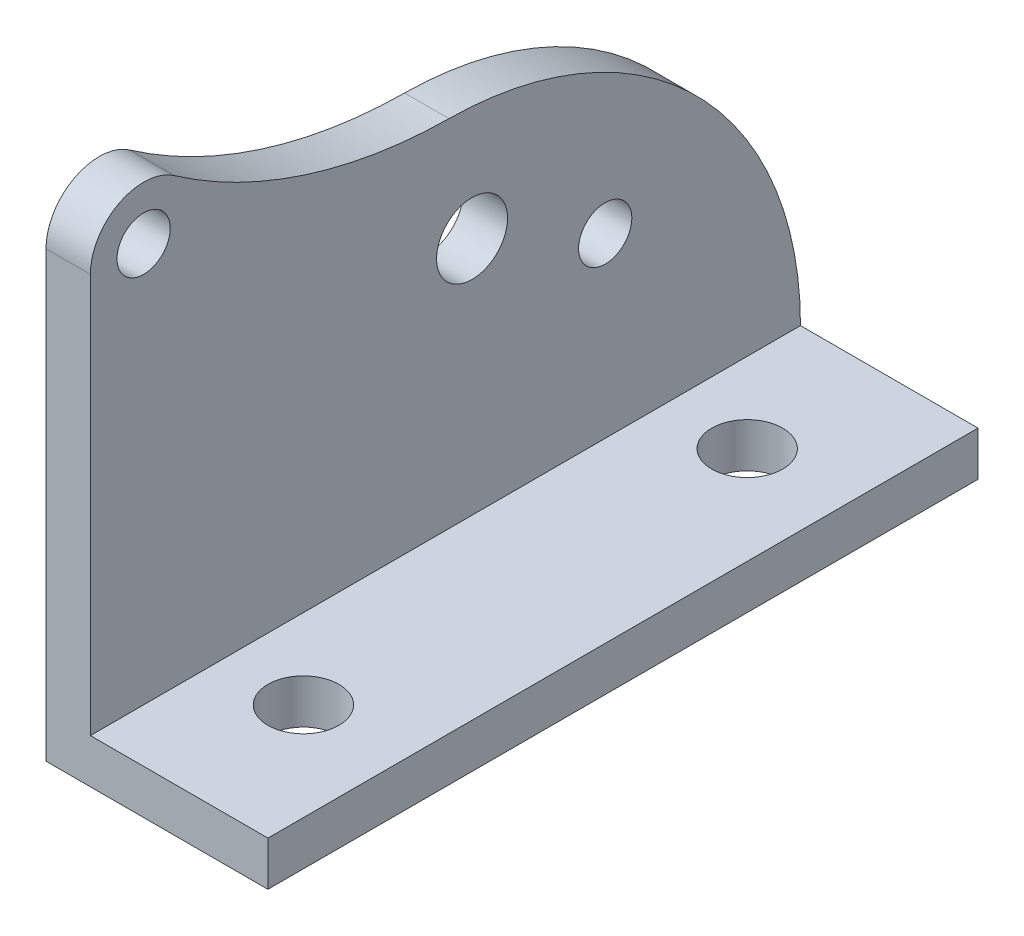
ISO-10303-21;
HEADER;
FILE_DESCRIPTION(('STEP AP214'),'2;1');
FILE_NAME('part.step','',(''),(''),'','','');
FILE_SCHEMA(('AUTOMOTIVE_DESIGN { 1 0 10303 214 1 1 1 1 }'));
ENDSEC;
DATA;
#1=APPLICATION_CONTEXT('core data for automotive mechanical design processes');
#2=APPLICATION_PROTOCOL_DEFINITION('international standard','automotive_design',2000,#1);
#3=PRODUCT_CONTEXT('',#1,'mechanical');
#4=PRODUCT('Part','Part','',(#3));
#5=PRODUCT_RELATED_PRODUCT_CATEGORY('part','',(#4));
#6=PRODUCT_DEFINITION_FORMATION('','',#4);
#7=PRODUCT_DEFINITION_CONTEXT('part definition',#1,'design');
#8=PRODUCT_DEFINITION('design','',#6,#7);
#9=PRODUCT_DEFINITION_SHAPE('','',#8);
#10=(LENGTH_UNIT() NAMED_UNIT(*) SI_UNIT(.MILLI.,.METRE.));
#11=(NAMED_UNIT(*) PLANE_ANGLE_UNIT() SI_UNIT($,.RADIAN.));
#12=(NAMED_UNIT(*) SI_UNIT($,.STERADIAN.) SOLID_ANGLE_UNIT());
#13=UNCERTAINTY_MEASURE_WITH_UNIT(LENGTH_MEASURE(1.E-05),#10,'distance_accuracy_value','');
#14=(GEOMETRIC_REPRESENTATION_CONTEXT(3) GLOBAL_UNCERTAINTY_ASSIGNED_CONTEXT((#13)) GLOBAL_UNIT_ASSIGNED_CONTEXT((#10,
#11,#12)) REPRESENTATION_CONTEXT('',''));
#15=CARTESIAN_POINT('',(0.,0.,0.));
#16=DIRECTION('',(0.,0.,1.));
#17=DIRECTION('',(1.,0.,0.));
#18=AXIS2_PLACEMENT_3D('',#15,#16,#17);
#19=CARTESIAN_POINT('',(5.,0.,0.));
#20=DIRECTION('',(1.,0.,0.));
#21=DIRECTION('',(0.,0.,-1.));
#22=AXIS2_PLACEMENT_3D('',#19,#20,#21);
#23=PLANE('',#22);
#24=CARTESIAN_POINT('',(5.,-25.,-18.));
#25=DIRECTION('',(1.,0.,0.));
#26=DIRECTION('',(0.,0.,-1.));
#27=AXIS2_PLACEMENT_3D('',#24,#25,#26);
#28=CIRCLE('',#27,3.);
#29=CARTESIAN_POINT('',(5.,-25.,-21.));
#30=VERTEX_POINT('',#29);
#31=EDGE_CURVE('E294',#30,#30,#28,.T.);
#32=ORIENTED_EDGE('',*,*,#31,.F.);
#33=EDGE_LOOP('',(#32));
#34=FACE_BOUND('',#33,.T.);
#35=CARTESIAN_POINT('',(5.,-18.,-2.99999999999999));
#36=DIRECTION('',(1.,0.,0.));
#37=DIRECTION('',(0.,0.,-1.));
#38=AXIS2_PLACEMENT_3D('',#35,#36,#37);
#39=CIRCLE('',#38,4.);
#40=CARTESIAN_POINT('',(5.,-18.,-6.99999999999999));
#41=VERTEX_POINT('',#40);
#42=EDGE_CURVE('E163',#41,#41,#39,.T.);
#43=ORIENTED_EDGE('',*,*,#42,.F.);
#44=EDGE_LOOP('',(#43));
#45=FACE_BOUND('',#44,.T.);
#46=CARTESIAN_POINT('',(5.,0.,34.));
#47=DIRECTION('',(1.,0.,0.));
#48=DIRECTION('',(0.,0.,-1.));
#49=AXIS2_PLACEMENT_3D('',#46,#47,#48);
#50=CIRCLE('',#49,5.99999999999999);
#51=CARTESIAN_POINT('',(5.,0.,40.));
#52=VERTEX_POINT('',#51);
#53=CARTESIAN_POINT('',(5.,4.91756595476615,30.5623343559146));
#54=VERTEX_POINT('',#53);
#55=EDGE_CURVE('E149',#52,#54,#50,.F.);
#56=ORIENTED_EDGE('',*,*,#55,.F.);
#57=DIRECTION('',(0.,-1.,0.));
#58=VECTOR('',#57,1.);
#59=CARTESIAN_POINT('',(5.,50.,40.));
#60=LINE('',#59,#58);
#61=CARTESIAN_POINT('',(5.,-45.,40.));
#62=VERTEX_POINT('',#61);
#63=EDGE_CURVE('E213',#52,#62,#60,.T.);
#64=ORIENTED_EDGE('',*,*,#63,.T.);
#65=DIRECTION('',(0.,0.,1.));
#66=VECTOR('',#65,1.);
#67=CARTESIAN_POINT('',(5.,-45.,40.));
#68=LINE('',#67,#66);
#69=CARTESIAN_POINT('',(5.,-45.,-40.));
#70=VERTEX_POINT('',#69);
#71=EDGE_CURVE('E181',#70,#62,#68,.T.);
#72=ORIENTED_EDGE('',*,*,#71,.F.);
#73=CARTESIAN_POINT('',(5.,-45.,0.));
#74=DIRECTION('',(1.,0.,0.));
#75=DIRECTION('',(0.,0.,-1.));
#76=AXIS2_PLACEMENT_3D('',#73,#74,#75);
#77=CIRCLE('',#76,40.);
#78=CARTESIAN_POINT('',(5.,-5.00199836907123,-0.399831879944413));
#79=VERTEX_POINT('',#78);
#80=EDGE_CURVE('E152',#79,#70,#77,.F.);
#81=ORIENTED_EDGE('',*,*,#80,.F.);
#82=CARTESIAN_POINT('',(5.,49.9952538734558,-0.949600714868));
#83=DIRECTION('',(1.,0.,0.));
#84=DIRECTION('',(0.,0.,-1.));
#85=AXIS2_PLACEMENT_3D('',#82,#83,#84);
#86=CIRCLE('',#85,55.);
#87=EDGE_CURVE('E135',#79,#54,#86,.F.);
#88=ORIENTED_EDGE('',*,*,#87,.T.);
#89=EDGE_LOOP('',(#56,#64,#72,#81,#88));
#90=FACE_BOUND('',#89,.T.);
#91=CARTESIAN_POINT('',(5.,0.,34.));
#92=DIRECTION('',(1.,0.,0.));
#93=DIRECTION('',(0.,0.,-1.));
#94=AXIS2_PLACEMENT_3D('',#91,#92,#93);
#95=CIRCLE('',#94,3.);
#96=CARTESIAN_POINT('',(5.,0.,31.));
#97=VERTEX_POINT('',#96);
#98=EDGE_CURVE('E155',#97,#97,#95,.F.);
#99=ORIENTED_EDGE('',*,*,#98,.T.);
#100=EDGE_LOOP('',(#99));
#101=FACE_BOUND('',#100,.T.);
#102=ADVANCED_FACE('F65',(#34,#45,#90,#101),#23,.T.);
#103=CARTESIAN_POINT('',(0.,0.,0.));
#104=DIRECTION('',(1.,0.,0.));
#105=DIRECTION('',(0.,0.,-1.));
#106=AXIS2_PLACEMENT_3D('',#103,#104,#105);
#107=PLANE('',#106);
#108=CARTESIAN_POINT('',(0.,-25.,-18.));
#109=DIRECTION('',(-1.,0.,0.));
#110=DIRECTION('',(0.,0.,1.));
#111=AXIS2_PLACEMENT_3D('',#108,#109,#110);
#112=CIRCLE('',#111,3.);
#113=CARTESIAN_POINT('',(0.,-25.,-15.));
#114=VERTEX_POINT('',#113);
#115=EDGE_CURVE('E297',#114,#114,#112,.T.);
#116=ORIENTED_EDGE('',*,*,#115,.F.);
#117=EDGE_LOOP('',(#116));
#118=FACE_BOUND('',#117,.T.);
#119=DIRECTION('',(0.,-1.,0.));
#120=VECTOR('',#119,1.);
#121=CARTESIAN_POINT('',(0.,50.,40.));
#122=LINE('',#121,#120);
#123=CARTESIAN_POINT('',(0.,0.,40.));
#124=VERTEX_POINT('',#123);
#125=CARTESIAN_POINT('',(0.,-50.,40.));
#126=VERTEX_POINT('',#125);
#127=EDGE_CURVE('E233',#124,#126,#122,.T.);
#128=ORIENTED_EDGE('',*,*,#127,.F.);
#129=CARTESIAN_POINT('',(0.,0.,34.));
#130=DIRECTION('',(1.,0.,0.));
#131=DIRECTION('',(0.,0.,-1.));
#132=AXIS2_PLACEMENT_3D('',#129,#130,#131);
#133=CIRCLE('',#132,5.99999999999999);
#134=CARTESIAN_POINT('',(0.,4.91756595476615,30.5623343559146));
#135=VERTEX_POINT('',#134);
#136=EDGE_CURVE('E137',#124,#135,#133,.F.);
#137=ORIENTED_EDGE('',*,*,#136,.T.);
#138=CARTESIAN_POINT('',(0.,49.9952538734558,-0.949600714868));
#139=DIRECTION('',(1.,0.,0.));
#140=DIRECTION('',(0.,0.,-1.));
#141=AXIS2_PLACEMENT_3D('',#138,#139,#140);
#142=CIRCLE('',#141,55.);
#143=CARTESIAN_POINT('',(0.,-5.00199836907123,-0.399831879944413));
#144=VERTEX_POINT('',#143);
#145=EDGE_CURVE('E132',#144,#135,#142,.F.);
#146=ORIENTED_EDGE('',*,*,#145,.F.);
#147=CARTESIAN_POINT('',(0.,-45.,0.));
#148=DIRECTION('',(1.,0.,0.));
#149=DIRECTION('',(0.,0.,-1.));
#150=AXIS2_PLACEMENT_3D('',#147,#148,#149);
#151=CIRCLE('',#150,40.);
#152=CARTESIAN_POINT('',(0.,-45.,-40.));
#153=VERTEX_POINT('',#152);
#154=EDGE_CURVE('E139',#144,#153,#151,.F.);
#155=ORIENTED_EDGE('',*,*,#154,.T.);
#156=DIRECTION('',(0.,1.,0.));
#157=VECTOR('',#156,1.);
#158=CARTESIAN_POINT('',(0.,50.,-40.));
#159=LINE('',#158,#157);
#160=CARTESIAN_POINT('',(0.,-50.,-40.));
#161=VERTEX_POINT('',#160);
#162=EDGE_CURVE('E210',#161,#153,#159,.T.);
#163=ORIENTED_EDGE('',*,*,#162,.F.);
#164=DIRECTION('',(0.,0.,-1.));
#165=VECTOR('',#164,1.);
#166=CARTESIAN_POINT('',(0.,-50.,40.));
#167=LINE('',#166,#165);
#168=EDGE_CURVE('E89',#126,#161,#167,.T.);
#169=ORIENTED_EDGE('',*,*,#168,.F.);
#170=EDGE_LOOP('',(#128,#137,#146,#155,#163,#169));
#171=FACE_BOUND('',#170,.T.);
#172=CARTESIAN_POINT('',(0.,-18.,-2.99999999999999));
#173=DIRECTION('',(1.,0.,0.));
#174=DIRECTION('',(0.,0.,-1.));
#175=AXIS2_PLACEMENT_3D('',#172,#173,#174);
#176=CIRCLE('',#175,4.);
#177=CARTESIAN_POINT('',(0.,-18.,-6.99999999999999));
#178=VERTEX_POINT('',#177);
#179=EDGE_CURVE('E166',#178,#178,#176,.T.);
#180=ORIENTED_EDGE('',*,*,#179,.T.);
#181=EDGE_LOOP('',(#180));
#182=FACE_BOUND('',#181,.T.);
#183=CARTESIAN_POINT('',(0.,0.,34.));
#184=DIRECTION('',(1.,0.,0.));
#185=DIRECTION('',(0.,0.,-1.));
#186=AXIS2_PLACEMENT_3D('',#183,#184,#185);
#187=CIRCLE('',#186,3.);
#188=CARTESIAN_POINT('',(0.,0.,31.));
#189=VERTEX_POINT('',#188);
#190=EDGE_CURVE('E159',#189,#189,#187,.F.);
#191=ORIENTED_EDGE('',*,*,#190,.F.);
#192=EDGE_LOOP('',(#191));
#193=FACE_BOUND('',#192,.T.);
#194=ADVANCED_FACE('F147',(#118,#171,#182,#193),#107,.F.);
#195=CARTESIAN_POINT('',(5.,50.,-40.));
#196=DIRECTION('',(0.,0.,1.));
#197=DIRECTION('',(0.,-1.,0.));
#198=AXIS2_PLACEMENT_3D('',#195,#196,#197);
#199=PLANE('',#198);
#200=DIRECTION('',(1.,0.,0.));
#201=VECTOR('',#200,1.);
#202=CARTESIAN_POINT('',(0.,-45.,-40.));
#203=LINE('',#202,#201);
#204=EDGE_CURVE('E82',#153,#70,#203,.T.);
#205=ORIENTED_EDGE('',*,*,#204,.T.);
#206=DIRECTION('',(-1.,0.,0.));
#207=VECTOR('',#206,1.);
#208=CARTESIAN_POINT('',(25.,-45.,-40.));
#209=LINE('',#208,#207);
#210=CARTESIAN_POINT('',(25.,-45.,-40.));
#211=VERTEX_POINT('',#210);
#212=EDGE_CURVE('E205',#211,#70,#209,.T.);
#213=ORIENTED_EDGE('',*,*,#212,.F.);
#214=DIRECTION('',(0.,1.,0.));
#215=VECTOR('',#214,1.);
#216=CARTESIAN_POINT('',(25.,-50.,-40.));
#217=LINE('',#216,#215);
#218=CARTESIAN_POINT('',(25.,-50.,-40.));
#219=VERTEX_POINT('',#218);
#220=EDGE_CURVE('E190',#219,#211,#217,.T.);
#221=ORIENTED_EDGE('',*,*,#220,.F.);
#222=DIRECTION('',(-1.,0.,0.));
#223=VECTOR('',#222,1.);
#224=CARTESIAN_POINT('',(5.,-50.,-40.));
#225=LINE('',#224,#223);
#226=EDGE_CURVE('E74',#219,#161,#225,.T.);
#227=ORIENTED_EDGE('',*,*,#226,.T.);
#228=ORIENTED_EDGE('',*,*,#162,.T.);
#229=EDGE_LOOP('',(#205,#213,#221,#227,#228));
#230=FACE_BOUND('',#229,.T.);
#231=ADVANCED_FACE('F67',(#230),#199,.F.);
#232=CARTESIAN_POINT('',(5.,50.,40.));
#233=DIRECTION('',(0.,0.,-1.));
#234=DIRECTION('',(0.,1.,0.));
#235=AXIS2_PLACEMENT_3D('',#232,#233,#234);
#236=PLANE('',#235);
#237=ORIENTED_EDGE('',*,*,#63,.F.);
#238=DIRECTION('',(1.,0.,0.));
#239=VECTOR('',#238,1.);
#240=CARTESIAN_POINT('',(0.,0.,40.));
#241=LINE('',#240,#239);
#242=EDGE_CURVE('E164',#124,#52,#241,.T.);
#243=ORIENTED_EDGE('',*,*,#242,.F.);
#244=ORIENTED_EDGE('',*,*,#127,.T.);
#245=DIRECTION('',(-1.,0.,0.));
#246=VECTOR('',#245,1.);
#247=CARTESIAN_POINT('',(5.,-50.,40.));
#248=LINE('',#247,#246);
#249=CARTESIAN_POINT('',(25.,-50.,40.));
#250=VERTEX_POINT('',#249);
#251=EDGE_CURVE('E14',#250,#126,#248,.T.);
#252=ORIENTED_EDGE('',*,*,#251,.F.);
#253=DIRECTION('',(0.,-1.,0.));
#254=VECTOR('',#253,1.);
#255=CARTESIAN_POINT('',(25.,-50.,40.));
#256=LINE('',#255,#254);
#257=CARTESIAN_POINT('',(25.,-45.,40.));
#258=VERTEX_POINT('',#257);
#259=EDGE_CURVE('E184',#258,#250,#256,.T.);
#260=ORIENTED_EDGE('',*,*,#259,.F.);
#261=DIRECTION('',(-1.,0.,0.));
#262=VECTOR('',#261,1.);
#263=CARTESIAN_POINT('',(25.,-45.,40.));
#264=LINE('',#263,#262);
#265=EDGE_CURVE('E194',#258,#62,#264,.T.);
#266=ORIENTED_EDGE('',*,*,#265,.T.);
#267=EDGE_LOOP('',(#237,#243,#244,#252,#260,#266));
#268=FACE_BOUND('',#267,.T.);
#269=ADVANCED_FACE('F238',(#268),#236,.F.);
#270=CARTESIAN_POINT('',(5.,-50.,40.));
#271=DIRECTION('',(0.,1.,0.));
#272=DIRECTION('',(0.,0.,1.));
#273=AXIS2_PLACEMENT_3D('',#270,#271,#272);
#274=PLANE('',#273);
#275=CARTESIAN_POINT('',(14.,-50.,25.));
#276=DIRECTION('',(0.,1.,0.));
#277=DIRECTION('',(0.,0.,1.));
#278=AXIS2_PLACEMENT_3D('',#275,#276,#277);
#279=CIRCLE('',#278,4.);
#280=CARTESIAN_POINT('',(14.,-50.,29.));
#281=VERTEX_POINT('',#280);
#282=EDGE_CURVE('E172',#281,#281,#279,.T.);
#283=ORIENTED_EDGE('',*,*,#282,.T.);
#284=EDGE_LOOP('',(#283));
#285=FACE_BOUND('',#284,.T.);
#286=CARTESIAN_POINT('',(14.,-50.,-25.));
#287=DIRECTION('',(0.,1.,0.));
#288=DIRECTION('',(0.,0.,1.));
#289=AXIS2_PLACEMENT_3D('',#286,#287,#288);
#290=CIRCLE('',#289,4.);
#291=CARTESIAN_POINT('',(14.,-50.,-21.));
#292=VERTEX_POINT('',#291);
#293=EDGE_CURVE('E178',#292,#292,#290,.T.);
#294=ORIENTED_EDGE('',*,*,#293,.T.);
#295=EDGE_LOOP('',(#294));
#296=FACE_BOUND('',#295,.T.);
#297=ORIENTED_EDGE('',*,*,#168,.T.);
#298=ORIENTED_EDGE('',*,*,#226,.F.);
#299=DIRECTION('',(0.,0.,-1.));
#300=VECTOR('',#299,1.);
#301=CARTESIAN_POINT('',(25.,-50.,40.));
#302=LINE('',#301,#300);
#303=EDGE_CURVE('E187',#250,#219,#302,.T.);
#304=ORIENTED_EDGE('',*,*,#303,.F.);
#305=ORIENTED_EDGE('',*,*,#251,.T.);
#306=EDGE_LOOP('',(#297,#298,#304,#305));
#307=FACE_BOUND('',#306,.T.);
#308=ADVANCED_FACE('F239',(#285,#296,#307),#274,.F.);
#309=CARTESIAN_POINT('',(25.,-45.,40.));
#310=DIRECTION('',(0.,-1.,0.));
#311=DIRECTION('',(0.,0.,-1.));
#312=AXIS2_PLACEMENT_3D('',#309,#310,#311);
#313=PLANE('',#312);
#314=CARTESIAN_POINT('',(14.,-45.,25.));
#315=DIRECTION('',(0.,1.,0.));
#316=DIRECTION('',(0.,0.,1.));
#317=AXIS2_PLACEMENT_3D('',#314,#315,#316);
#318=CIRCLE('',#317,4.);
#319=CARTESIAN_POINT('',(14.,-45.,29.));
#320=VERTEX_POINT('',#319);
#321=EDGE_CURVE('E169',#320,#320,#318,.T.);
#322=ORIENTED_EDGE('',*,*,#321,.F.);
#323=EDGE_LOOP('',(#322));
#324=FACE_BOUND('',#323,.T.);
#325=CARTESIAN_POINT('',(14.,-45.,-25.));
#326=DIRECTION('',(0.,1.,0.));
#327=DIRECTION('',(0.,0.,1.));
#328=AXIS2_PLACEMENT_3D('',#325,#326,#327);
#329=CIRCLE('',#328,4.);
#330=CARTESIAN_POINT('',(14.,-45.,-21.));
#331=VERTEX_POINT('',#330);
#332=EDGE_CURVE('E175',#331,#331,#329,.T.);
#333=ORIENTED_EDGE('',*,*,#332,.F.);
#334=EDGE_LOOP('',(#333));
#335=FACE_BOUND('',#334,.T.);
#336=ORIENTED_EDGE('',*,*,#71,.T.);
#337=ORIENTED_EDGE('',*,*,#265,.F.);
#338=DIRECTION('',(0.,0.,1.));
#339=VECTOR('',#338,1.);
#340=CARTESIAN_POINT('',(25.,-45.,40.));
#341=LINE('',#340,#339);
#342=EDGE_CURVE('E192',#211,#258,#341,.T.);
#343=ORIENTED_EDGE('',*,*,#342,.F.);
#344=ORIENTED_EDGE('',*,*,#212,.T.);
#345=EDGE_LOOP('',(#336,#337,#343,#344));
#346=FACE_BOUND('',#345,.T.);
#347=ADVANCED_FACE('F228',(#324,#335,#346),#313,.F.);
#348=CARTESIAN_POINT('',(25.,0.,0.));
#349=DIRECTION('',(-1.,0.,0.));
#350=DIRECTION('',(0.,0.,1.));
#351=AXIS2_PLACEMENT_3D('',#348,#349,#350);
#352=PLANE('',#351);
#353=ORIENTED_EDGE('',*,*,#259,.T.);
#354=ORIENTED_EDGE('',*,*,#303,.T.);
#355=ORIENTED_EDGE('',*,*,#220,.T.);
#356=ORIENTED_EDGE('',*,*,#342,.T.);
#357=EDGE_LOOP('',(#353,#354,#355,#356));
#358=FACE_BOUND('',#357,.T.);
#359=ADVANCED_FACE('F231',(#358),#352,.F.);
#360=CARTESIAN_POINT('',(14.,-50.,-25.));
#361=DIRECTION('',(0.,1.,0.));
#362=DIRECTION('',(0.,0.,1.));
#363=AXIS2_PLACEMENT_3D('',#360,#361,#362);
#364=CYLINDRICAL_SURFACE('',#363,4.);
#365=ORIENTED_EDGE('',*,*,#293,.F.);
#366=EDGE_LOOP('',(#365));
#367=FACE_BOUND('',#366,.T.);
#368=ORIENTED_EDGE('',*,*,#332,.T.);
#369=EDGE_LOOP('',(#368));
#370=FACE_BOUND('',#369,.T.);
#371=ADVANCED_FACE('F263',(#367,#370),#364,.F.);
#372=CARTESIAN_POINT('',(14.,-50.,25.));
#373=DIRECTION('',(0.,1.,0.));
#374=DIRECTION('',(0.,0.,1.));
#375=AXIS2_PLACEMENT_3D('',#372,#373,#374);
#376=CYLINDRICAL_SURFACE('',#375,4.);
#377=ORIENTED_EDGE('',*,*,#282,.F.);
#378=EDGE_LOOP('',(#377));
#379=FACE_BOUND('',#378,.T.);
#380=ORIENTED_EDGE('',*,*,#321,.T.);
#381=EDGE_LOOP('',(#380));
#382=FACE_BOUND('',#381,.T.);
#383=ADVANCED_FACE('F266',(#379,#382),#376,.F.);
#384=CARTESIAN_POINT('',(0.,-18.,-2.99999999999999));
#385=DIRECTION('',(1.,0.,0.));
#386=DIRECTION('',(0.,0.,-1.));
#387=AXIS2_PLACEMENT_3D('',#384,#385,#386);
#388=CYLINDRICAL_SURFACE('',#387,4.);
#389=ORIENTED_EDGE('',*,*,#179,.F.);
#390=EDGE_LOOP('',(#389));
#391=FACE_BOUND('',#390,.T.);
#392=ORIENTED_EDGE('',*,*,#42,.T.);
#393=EDGE_LOOP('',(#392));
#394=FACE_BOUND('',#393,.T.);
#395=ADVANCED_FACE('F270',(#391,#394),#388,.F.);
#396=CARTESIAN_POINT('',(0.,49.9952538734558,-0.949600714868));
#397=DIRECTION('',(1.,0.,0.));
#398=DIRECTION('',(0.,0.,-1.));
#399=AXIS2_PLACEMENT_3D('',#396,#397,#398);
#400=CYLINDRICAL_SURFACE('',#399,55.);
#401=ORIENTED_EDGE('',*,*,#87,.F.);
#402=DIRECTION('',(1.,0.,0.));
#403=VECTOR('',#402,1.);
#404=CARTESIAN_POINT('',(0.,-5.00199836907123,-0.399831879944413));
#405=LINE('',#404,#403);
#406=EDGE_CURVE('E129',#144,#79,#405,.T.);
#407=ORIENTED_EDGE('',*,*,#406,.F.);
#408=ORIENTED_EDGE('',*,*,#145,.T.);
#409=DIRECTION('',(1.,0.,0.));
#410=VECTOR('',#409,1.);
#411=CARTESIAN_POINT('',(0.,4.91756595476615,30.5623343559146));
#412=LINE('',#411,#410);
#413=EDGE_CURVE('E161',#135,#54,#412,.T.);
#414=ORIENTED_EDGE('',*,*,#413,.T.);
#415=EDGE_LOOP('',(#401,#407,#408,#414));
#416=FACE_BOUND('',#415,.T.);
#417=ADVANCED_FACE('F130',(#416),#400,.F.);
#418=CARTESIAN_POINT('',(0.,0.,34.));
#419=DIRECTION('',(1.,0.,0.));
#420=DIRECTION('',(0.,0.,-1.));
#421=AXIS2_PLACEMENT_3D('',#418,#419,#420);
#422=CYLINDRICAL_SURFACE('',#421,5.99999999999999);
#423=ORIENTED_EDGE('',*,*,#55,.T.);
#424=ORIENTED_EDGE('',*,*,#413,.F.);
#425=ORIENTED_EDGE('',*,*,#136,.F.);
#426=ORIENTED_EDGE('',*,*,#242,.T.);
#427=EDGE_LOOP('',(#423,#424,#425,#426));
#428=FACE_BOUND('',#427,.T.);
#429=ADVANCED_FACE('F277',(#428),#422,.T.);
#430=CARTESIAN_POINT('',(0.,-45.,0.));
#431=DIRECTION('',(1.,0.,0.));
#432=DIRECTION('',(0.,0.,-1.));
#433=AXIS2_PLACEMENT_3D('',#430,#431,#432);
#434=CYLINDRICAL_SURFACE('',#433,40.);
#435=ORIENTED_EDGE('',*,*,#80,.T.);
#436=ORIENTED_EDGE('',*,*,#204,.F.);
#437=ORIENTED_EDGE('',*,*,#154,.F.);
#438=ORIENTED_EDGE('',*,*,#406,.T.);
#439=EDGE_LOOP('',(#435,#436,#437,#438));
#440=FACE_BOUND('',#439,.T.);
#441=ADVANCED_FACE('F140',(#440),#434,.T.);
#442=CARTESIAN_POINT('',(0.,0.,34.));
#443=DIRECTION('',(1.,0.,0.));
#444=DIRECTION('',(0.,0.,-1.));
#445=AXIS2_PLACEMENT_3D('',#442,#443,#444);
#446=CYLINDRICAL_SURFACE('',#445,3.);
#447=ORIENTED_EDGE('',*,*,#190,.T.);
#448=EDGE_LOOP('',(#447));
#449=FACE_BOUND('',#448,.T.);
#450=ORIENTED_EDGE('',*,*,#98,.F.);
#451=EDGE_LOOP('',(#450));
#452=FACE_BOUND('',#451,.T.);
#453=ADVANCED_FACE('F280',(#449,#452),#446,.F.);
#454=CARTESIAN_POINT('',(10.,-25.,-18.));
#455=DIRECTION('',(-1.,0.,0.));
#456=DIRECTION('',(0.,0.,1.));
#457=AXIS2_PLACEMENT_3D('',#454,#455,#456);
#458=CYLINDRICAL_SURFACE('',#457,3.);
#459=ORIENTED_EDGE('',*,*,#31,.T.);
#460=EDGE_LOOP('',(#459));
#461=FACE_BOUND('',#460,.T.);
#462=ORIENTED_EDGE('',*,*,#115,.T.);
#463=EDGE_LOOP('',(#462));
#464=FACE_BOUND('',#463,.T.);
#465=ADVANCED_FACE('F286',(#461,#464),#458,.F.);
#466=CLOSED_SHELL('',(#102,#194,#231,#269,#308,#347,#359,#371,#383,#395,#417,#429,#441,#453,#465));
#467=MANIFOLD_SOLID_BREP('B2',#466);
#468=ADVANCED_BREP_SHAPE_REPRESENTATION('',(#18,#467),#14);
#469=SHAPE_DEFINITION_REPRESENTATION(#9,#468);
ENDSEC;
END-ISO-10303-21;
